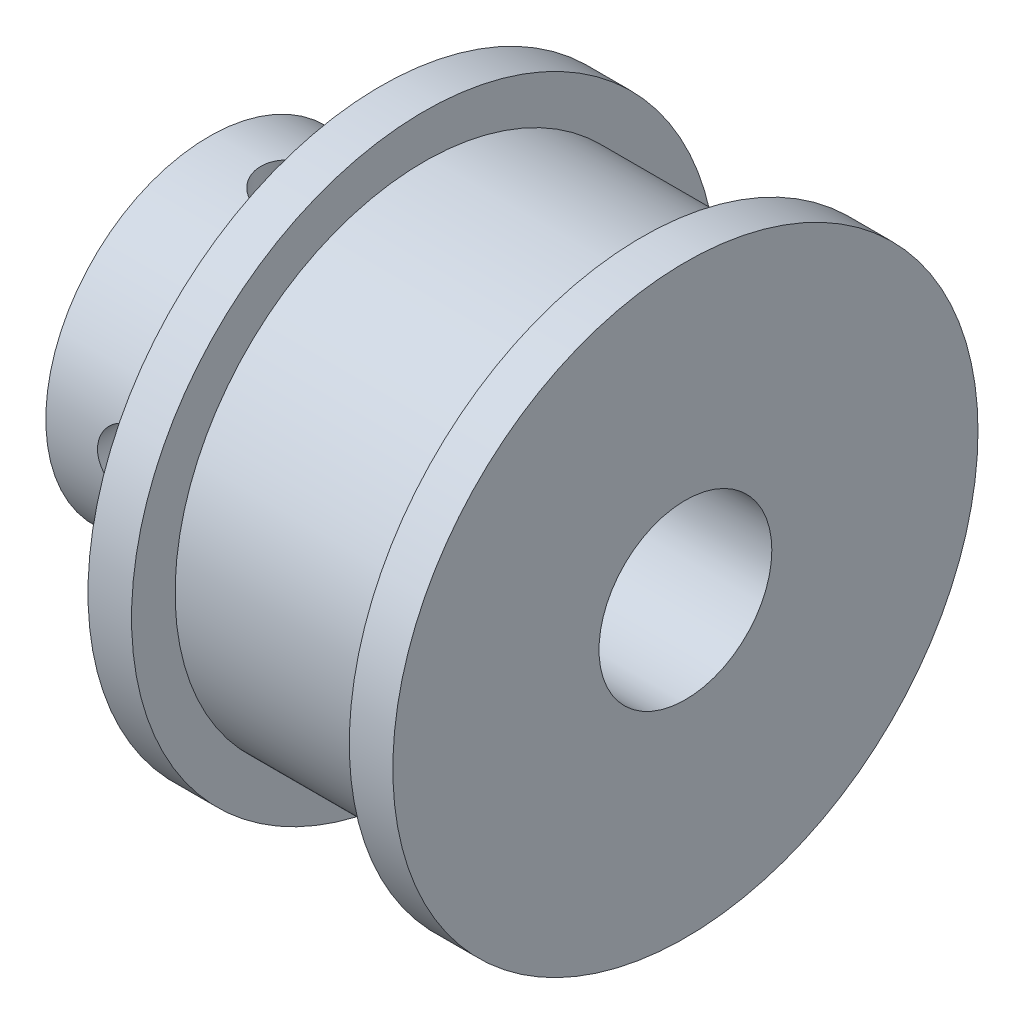
ISO-10303-21;
HEADER;
FILE_DESCRIPTION(('STEP AP214'),'2;1');
FILE_NAME('part.step','',(''),(''),'','','');
FILE_SCHEMA(('AUTOMOTIVE_DESIGN { 1 0 10303 214 1 1 1 1 }'));
ENDSEC;
DATA;
#1=APPLICATION_CONTEXT('core data for automotive mechanical design processes');
#2=APPLICATION_PROTOCOL_DEFINITION('international standard','automotive_design',2000,#1);
#3=PRODUCT_CONTEXT('',#1,'mechanical');
#4=PRODUCT('Part','Part','',(#3));
#5=PRODUCT_RELATED_PRODUCT_CATEGORY('part','',(#4));
#6=PRODUCT_DEFINITION_FORMATION('','',#4);
#7=PRODUCT_DEFINITION_CONTEXT('part definition',#1,'design');
#8=PRODUCT_DEFINITION('design','',#6,#7);
#9=PRODUCT_DEFINITION_SHAPE('','',#8);
#10=(LENGTH_UNIT() NAMED_UNIT(*) SI_UNIT(.MILLI.,.METRE.));
#11=(NAMED_UNIT(*) PLANE_ANGLE_UNIT() SI_UNIT($,.RADIAN.));
#12=(NAMED_UNIT(*) SI_UNIT($,.STERADIAN.) SOLID_ANGLE_UNIT());
#13=UNCERTAINTY_MEASURE_WITH_UNIT(LENGTH_MEASURE(1.E-05),#10,'distance_accuracy_value','');
#14=(GEOMETRIC_REPRESENTATION_CONTEXT(3) GLOBAL_UNCERTAINTY_ASSIGNED_CONTEXT((#13)) GLOBAL_UNIT_ASSIGNED_CONTEXT((#10,
#11,#12)) REPRESENTATION_CONTEXT('',''));
#15=CARTESIAN_POINT('',(0.,0.,0.));
#16=DIRECTION('',(0.,0.,1.));
#17=DIRECTION('',(1.,0.,0.));
#18=AXIS2_PLACEMENT_3D('',#15,#16,#17);
#19=CARTESIAN_POINT('',(0.,0.,0.));
#20=DIRECTION('',(1.,0.,0.));
#21=DIRECTION('',(0.,0.,-1.));
#22=AXIS2_PLACEMENT_3D('',#19,#20,#21);
#23=CYLINDRICAL_SURFACE('',#22,3.175);
#24=CARTESIAN_POINT('',(1.90000000000001,0.,3.175));
#25=CARTESIAN_POINT('',(1.9000068627745,0.0672847316330924,3.17499501338285));
#26=CARTESIAN_POINT('',(1.90546359305505,0.1346703640608,3.17283650663751));
#27=CARTESIAN_POINT('',(1.92710352845715,0.267542369031608,3.16441250521978));
#28=CARTESIAN_POINT('',(1.94331412522152,0.333023444641002,3.15813652319774));
#29=CARTESIAN_POINT('',(1.9857829777871,0.459957962416117,3.14215557601542));
#30=CARTESIAN_POINT('',(2.01200951215206,0.521423409993961,3.1324614438269));
#31=CARTESIAN_POINT('',(2.07364090841074,0.63903164640658,3.11060223187218));
#32=CARTESIAN_POINT('',(2.1090429677438,0.695176053354679,3.09843790684371));
#33=CARTESIAN_POINT('',(2.1897376821198,0.803199302091193,3.07224897424454));
#34=CARTESIAN_POINT('',(2.23538195508738,0.854801684849634,3.05816785515032));
#35=CARTESIAN_POINT('',(2.33452307874792,0.949851027050096,3.029995134943));
#36=CARTESIAN_POINT('',(2.38802352829044,0.993294227940917,3.01590353198658));
#37=CARTESIAN_POINT('',(2.5041424024409,1.07262244667806,2.98863572549245));
#38=CARTESIAN_POINT('',(2.56705314443539,1.10810421355732,2.97552454842956));
#39=CARTESIAN_POINT('',(2.698544027874,1.16785949338492,2.95258553832485));
#40=CARTESIAN_POINT('',(2.7671215628923,1.19213812572271,2.94275620617845));
#41=CARTESIAN_POINT('',(2.90482457540723,1.22768807019404,2.92809906106053));
#42=CARTESIAN_POINT('',(2.97379138336201,1.2394876533875,2.92306908743274));
#43=CARTESIAN_POINT('',(3.11289538673181,1.25139521634013,2.91799267608066));
#44=CARTESIAN_POINT('',(3.18303201481214,1.2515087076257,2.91794388907308));
#45=CARTESIAN_POINT('',(3.31747264612622,1.24044215294952,2.92266241514435));
#46=CARTESIAN_POINT('',(3.38185243388379,1.2300187638983,2.9271070555664));
#47=CARTESIAN_POINT('',(3.50786207063953,1.19943319152663,2.93977143360488));
#48=CARTESIAN_POINT('',(3.56949145415953,1.17926936651212,2.94799180758784));
#49=CARTESIAN_POINT('',(3.68970949878321,1.12939589279822,2.9674595549287));
#50=CARTESIAN_POINT('',(3.74821240698525,1.09950293840843,2.97876432051874));
#51=CARTESIAN_POINT('',(3.85958183190654,1.03114819003906,3.00311044973729));
#52=CARTESIAN_POINT('',(3.91244626347388,0.992683242204219,3.01615245182717));
#53=CARTESIAN_POINT('',(4.01519223792226,0.90489847311778,3.04369028436772));
#54=CARTESIAN_POINT('',(4.06455620057866,0.854982538626526,3.05822195069566));
#55=CARTESIAN_POINT('',(4.15437521291328,0.747422600693478,3.08627133748347));
#56=CARTESIAN_POINT('',(4.19482859712145,0.68977715576794,3.09978886808114));
#57=CARTESIAN_POINT('',(4.26632885010501,0.566964697663757,3.12460676760529));
#58=CARTESIAN_POINT('',(4.29718676961865,0.501677729871156,3.13586122258918));
#59=CARTESIAN_POINT('',(4.34730502697112,0.366284378650628,3.15453954285868));
#60=CARTESIAN_POINT('',(4.36657106552982,0.296180383098904,3.16196529078971));
#61=CARTESIAN_POINT('',(4.39192526522841,0.15748598181363,3.17180954080983));
#62=CARTESIAN_POINT('',(4.398709348115,0.08904145870925,3.174492125026));
#63=CARTESIAN_POINT('',(4.4009546291958,-0.0480536320474739,3.17537559014029));
#64=CARTESIAN_POINT('',(4.39641864995898,-0.116704144074904,3.17357758823769));
#65=CARTESIAN_POINT('',(4.3766688987383,-0.249146112043378,3.1658751934269));
#66=CARTESIAN_POINT('',(4.36192521803439,-0.313019327348947,3.16015168509209));
#67=CARTESIAN_POINT('',(4.32281288402532,-0.437330047990826,3.14535985768854));
#68=CARTESIAN_POINT('',(4.29844298886303,-0.497767108885045,3.1362911070673));
#69=CARTESIAN_POINT('',(4.23997777394203,-0.615550644692232,3.11535083253378));
#70=CARTESIAN_POINT('',(4.20560984846939,-0.672747743207499,3.10340262881889));
#71=CARTESIAN_POINT('',(4.12842792642724,-0.780761917259374,3.07800576012949));
#72=CARTESIAN_POINT('',(4.08561060602606,-0.831576469108153,3.06455650557748));
#73=CARTESIAN_POINT('',(3.98952965745297,-0.928791348114859,3.0365593899859));
#74=CARTESIAN_POINT('',(3.93577293586608,-0.974701227513619,3.02199629492691));
#75=CARTESIAN_POINT('',(3.82105274982168,-1.05696284943212,2.99421855171024));
#76=CARTESIAN_POINT('',(3.76008825217309,-1.09331321924023,2.98100409737911));
#77=CARTESIAN_POINT('',(3.63187774635261,-1.15559997165607,2.95742074651155));
#78=CARTESIAN_POINT('',(3.56458459593159,-1.18144907129597,2.9470759174758));
#79=CARTESIAN_POINT('',(3.4260725952737,-1.2212562072246,2.93080697789355));
#80=CARTESIAN_POINT('',(3.35485655568267,-1.23522264211379,2.92487974538276));
#81=CARTESIAN_POINT('',(3.21589405502895,-1.25007804085777,2.91855940228496));
#82=CARTESIAN_POINT('',(3.1482538653394,-1.25181430561831,2.91780781401761));
#83=CARTESIAN_POINT('',(3.01369577979596,-1.24437120429059,2.92098982763324));
#84=CARTESIAN_POINT('',(2.94677779981834,-1.23519312367105,2.92492287776943));
#85=CARTESIAN_POINT('',(2.81810207173594,-1.20686591196944,2.93671925445626));
#86=CARTESIAN_POINT('',(2.75624498467543,-1.18809939057282,2.9444313340829));
#87=CARTESIAN_POINT('',(2.63652982106708,-1.14148049607648,2.96281485611587));
#88=CARTESIAN_POINT('',(2.57867280512971,-1.1136257243581,2.97348707966731));
#89=CARTESIAN_POINT('',(2.4650674647447,-1.04781462002773,2.99733186522452));
#90=CARTESIAN_POINT('',(2.40961923756217,-1.00937948877753,3.01061106475901));
#91=CARTESIAN_POINT('',(2.30568987821778,-0.924206507043676,3.0378387527675));
#92=CARTESIAN_POINT('',(2.25721118976831,-0.877465757163235,3.05178747371865));
#93=CARTESIAN_POINT('',(2.16551587816836,-0.773553196077986,3.07982295515274));
#94=CARTESIAN_POINT('',(2.12281309958007,-0.715913819660185,3.09386447942524));
#95=CARTESIAN_POINT('',(2.04769454049986,-0.5937664037964,3.11960779538581));
#96=CARTESIAN_POINT('',(2.01528012935281,-0.529257451559142,3.13130927554577));
#97=CARTESIAN_POINT('',(1.96417540099936,-0.400855491445671,3.15020502613284));
#98=CARTESIAN_POINT('',(1.94455266817755,-0.337376283301317,3.15769788512325));
#99=CARTESIAN_POINT('',(1.91563614784328,-0.207895662632507,3.16884766902594));
#100=CARTESIAN_POINT('',(1.90631397142025,-0.141901703524203,3.17251513536217));
#101=CARTESIAN_POINT('',(1.90076135384054,-0.0504531001608372,3.17470085654944));
#102=CARTESIAN_POINT('',(1.8999974262687,-0.0252336457199433,3.17500187012012));
#103=CARTESIAN_POINT('',(1.90000000000001,0.,3.175));
#104=B_SPLINE_CURVE_WITH_KNOTS('',3,(#24,#25,#26,#27,#28,#29,#30,#31,#32,#33,#34,#35,#36,#37,
#38,#39,#40,#41,#42,#43,#44,#45,#46,#47,#48,#49,#50,#51,#52,#53,#54,#55,#56,#57,#58,#59,#60,#61,
#62,#63,#64,#65,#66,#67,#68,#69,#70,#71,#72,#73,#74,#75,#76,#77,#78,#79,#80,#81,#82,#83,#84,#85,
#86,#87,#88,#89,#90,#91,#92,#93,#94,#95,#96,#97,#98,#99,#100,#101,#102,#103),.UNSPECIFIED.,.T.,
.F.,(4,2,2,2,2,2,2,2,2,2,2,2,2,2,2,2,2,2,2,2,2,2,2,2,2,2,2,2,2,2,2,2,2,2,2,2,2,2,2,4),(0.,
0.201779437744548,0.404074820308127,0.605734757050763,0.807333171478417,1.01735976436243,
1.2274828705813,1.44660259463333,1.66562209023744,1.87494520835713,2.08416960269575,
2.27936669865592,2.47459670544107,2.67374147234743,2.87295963102294,3.08705517744558,
3.30119070642572,3.51930901537433,3.73731996902137,3.94275765182502,4.14814411546712,
4.34465147529728,4.54118419440118,4.7436789821994,4.94625358697288,5.1617892735487,
5.37735589340512,5.59467927329235,5.81184892233299,6.01381057507249,6.21574844354767,
6.41019345194811,6.60468982086286,6.81009090996547,7.01556384361703,7.2337987698656,
7.45206273023339,7.65177261299093,7.85093070050895,7.92660360165657),.UNSPECIFIED.);
#105=CARTESIAN_POINT('',(1.90000000000001,0.,3.175));
#106=VERTEX_POINT('',#105);
#107=EDGE_CURVE('E37',#106,#106,#104,.T.);
#108=ORIENTED_EDGE('',*,*,#107,.F.);
#109=EDGE_LOOP('',(#108));
#110=FACE_BOUND('',#109,.T.);
#111=CARTESIAN_POINT('',(3.15,2.91858270398493,-1.25));
#112=CARTESIAN_POINT('',(3.21705876770274,2.91858919552523,-1.24999286391997));
#113=CARTESIAN_POINT('',(3.28421776991305,2.92092645038722,-1.24457161253238));
#114=CARTESIAN_POINT('',(3.41661509708975,2.92998517442319,-1.2230858011541));
#115=CARTESIAN_POINT('',(3.48184795863823,2.93671805691524,-1.20699353198018));
#116=CARTESIAN_POINT('',(3.60825570633315,2.95367783504784,-1.16486992778129));
#117=CARTESIAN_POINT('',(3.66944461339327,2.96389181028401,-1.13887530486567));
#118=CARTESIAN_POINT('',(3.78657755098346,2.98664490940932,-1.07779173231123));
#119=CARTESIAN_POINT('',(3.84252284402701,2.99918347142755,-1.04270497949831));
#120=CARTESIAN_POINT('',(3.95071189018399,3.02595080926506,-0.962353829492942));
#121=CARTESIAN_POINT('',(4.00262881457917,3.04023283739072,-0.916666915264533));
#122=CARTESIAN_POINT('',(4.09830169841413,3.06843728874988,-0.817302314146456));
#123=CARTESIAN_POINT('',(4.1420548518516,3.08235958692784,-0.763621891133198));
#124=CARTESIAN_POINT('',(4.22176349783716,3.10891201177461,-0.64728579706301));
#125=CARTESIAN_POINT('',(4.25735944266869,3.12147292007291,-0.584366556004033));
#126=CARTESIAN_POINT('',(4.31732314068053,3.14324422109986,-0.452850465301555));
#127=CARTESIAN_POINT('',(4.34169532800117,3.15245593668199,-0.384255870461471));
#128=CARTESIAN_POINT('',(4.37736018254707,3.16611423056324,-0.2467608971739));
#129=CARTESIAN_POINT('',(4.38921442617454,3.17076466636064,-0.178026840226493));
#130=CARTESIAN_POINT('',(4.40131288966092,3.17551190440968,-0.0393983009347702));
#131=CARTESIAN_POINT('',(4.40156129942229,3.17561035000669,0.0304957535146294));
#132=CARTESIAN_POINT('',(4.39075388885007,3.17136802875332,0.165409649899385));
#133=CARTESIAN_POINT('',(4.380312782763,3.16726865978232,0.230487686315578));
#134=CARTESIAN_POINT('',(4.34946532592636,3.15541444614498,0.357881536818985));
#135=CARTESIAN_POINT('',(4.32905824593686,3.14765933397851,0.420197148407344));
#136=CARTESIAN_POINT('',(4.27860558354179,3.12910832817148,0.541410179653869));
#137=CARTESIAN_POINT('',(4.24842031728481,3.11826866169305,0.600242482304685));
#138=CARTESIAN_POINT('',(4.17939703639771,3.09462975143761,0.712157346885298));
#139=CARTESIAN_POINT('',(4.1405560971742,3.08182984578998,0.765237956392509));
#140=CARTESIAN_POINT('',(4.05243182003348,3.05461022779038,0.867739124124568));
#141=CARTESIAN_POINT('',(4.00264013608172,3.04013927358102,0.916709689716655));
#142=CARTESIAN_POINT('',(3.89548656480707,3.01184461230875,1.00578635680649));
#143=CARTESIAN_POINT('',(3.83812236311636,2.99802110488019,1.04588973818711));
#144=CARTESIAN_POINT('',(3.71550154425415,2.9722444532213,1.11707822475766));
#145=CARTESIAN_POINT('',(3.6500754582507,2.96035090580402,1.14789479354929));
#146=CARTESIAN_POINT('',(3.5143696785953,2.94047661183176,1.19789603572418));
#147=CARTESIAN_POINT('',(3.44409305117512,2.93249341875955,1.21708798384633));
#148=CARTESIAN_POINT('',(3.30516034266536,2.92193314346724,1.24221885837745));
#149=CARTESIAN_POINT('',(3.2366574611002,2.9190621155793,1.24887973581001));
#150=CARTESIAN_POINT('',(3.09946758767574,2.91821507641654,1.25085924710212));
#151=CARTESIAN_POINT('',(3.03078065469026,2.92023765193577,1.24618115550066));
#152=CARTESIAN_POINT('',(2.89910081239854,2.92864903711891,1.22627220656949));
#153=CARTESIAN_POINT('',(2.83600149325999,2.93479414330475,1.21162973372095));
#154=CARTESIAN_POINT('',(2.71319369775327,2.95045928061593,1.17296502005911));
#155=CARTESIAN_POINT('',(2.65348596177989,2.95998004539956,1.14894074010909));
#156=CARTESIAN_POINT('',(2.53650689226705,2.98178824537218,1.09112415058302));
#157=CARTESIAN_POINT('',(2.47942723563771,2.99417074871089,1.05698098829747));
#158=CARTESIAN_POINT('',(2.37155358654007,3.02015852173764,0.980258179031947));
#159=CARTESIAN_POINT('',(2.32076210314278,3.03376427580628,0.937675181950988));
#160=CARTESIAN_POINT('',(2.22315311375844,3.06183438952279,0.841703377564378));
#161=CARTESIAN_POINT('',(2.17687527629868,3.07629098175068,0.787761391689884));
#162=CARTESIAN_POINT('',(2.09394958907587,3.1035190255834,0.672529083864432));
#163=CARTESIAN_POINT('',(2.05730202921282,3.1162904264532,0.611238540780897));
#164=CARTESIAN_POINT('',(1.99484313276734,3.13873566281396,0.482904338615098));
#165=CARTESIAN_POINT('',(1.96901930828488,3.14841306493411,0.415867417631866));
#166=CARTESIAN_POINT('',(1.92917965457089,3.16357142711523,0.277927786036162));
#167=CARTESIAN_POINT('',(1.91515764017672,3.16905458518296,0.207027121129187));
#168=CARTESIAN_POINT('',(1.90003726977397,3.17497850608976,0.0682260342168539));
#169=CARTESIAN_POINT('',(1.89817498964644,3.17571727826717,0.000420884757595325));
#170=CARTESIAN_POINT('',(1.90542306137319,3.1728670277863,-0.134500374630681));
#171=CARTESIAN_POINT('',(1.9145318409792,3.16927862524971,-0.201616581901098));
#172=CARTESIAN_POINT('',(1.94291936225415,3.15832315585951,-0.331261459507754));
#173=CARTESIAN_POINT('',(1.96189513645233,3.15106882901496,-0.393866748155006));
#174=CARTESIAN_POINT('',(2.00916415022582,3.13355246801338,-0.514998013360591));
#175=CARTESIAN_POINT('',(2.03745913359075,3.12328987099511,-0.573523223978585));
#176=CARTESIAN_POINT('',(2.10396081746341,3.10021124636329,-0.687642991756168));
#177=CARTESIAN_POINT('',(2.14254680575914,3.08730319204293,-0.742997519181306));
#178=CARTESIAN_POINT('',(2.22796048608835,3.0604965861267,-0.846674739986252));
#179=CARTESIAN_POINT('',(2.27479143506869,3.04659764440369,-0.894994640697079));
#180=CARTESIAN_POINT('',(2.3786645370051,3.01835076024438,-0.986204093974814));
#181=CARTESIAN_POINT('',(2.43614870477354,3.00402537078839,-1.02859889387657));
#182=CARTESIAN_POINT('',(2.55787929604743,2.97745127531598,-1.10316965268165));
#183=CARTESIAN_POINT('',(2.62212660256846,2.96520284101944,-1.13534427499941));
#184=CARTESIAN_POINT('',(2.74980593068555,2.94527735121899,-1.18601952811124));
#185=CARTESIAN_POINT('',(2.81281216952646,2.93729286701932,-1.20547430735444));
#186=CARTESIAN_POINT('',(2.94135798876503,2.92533709276108,-1.23421212719399));
#187=CARTESIAN_POINT('',(3.00688989438575,2.92135450819833,-1.24352380081826));
#188=CARTESIAN_POINT('',(3.09843968257498,2.91892238480656,-1.24920484852849));
#189=CARTESIAN_POINT('',(3.12421242994352,2.91858020765141,-1.25000274419244));
#190=CARTESIAN_POINT('',(3.15,2.91858270398493,-1.25));
#191=B_SPLINE_CURVE_WITH_KNOTS('',3,(#111,#112,#113,#114,#115,#116,#117,#118,#119,#120,#121,
#122,#123,#124,#125,#126,#127,#128,#129,#130,#131,#132,#133,#134,#135,#136,#137,#138,#139,#140,
#141,#142,#143,#144,#145,#146,#147,#148,#149,#150,#151,#152,#153,#154,#155,#156,#157,#158,#159,
#160,#161,#162,#163,#164,#165,#166,#167,#168,#169,#170,#171,#172,#173,#174,#175,#176,#177,#178,
#179,#180,#181,#182,#183,#184,#185,#186,#187,#188,#189,#190),.UNSPECIFIED.,.T.,.F.,(4,2,2,2,2,2,
2,2,2,2,2,2,2,2,2,2,2,2,2,2,2,2,2,2,2,2,2,2,2,2,2,2,2,2,2,2,2,2,2,4),(0.,0.20109806062216,
0.402720363484106,0.603602331741175,0.804435808400704,1.01535170829682,1.22633996993093,
1.44534686764129,1.66426716849029,1.87288447318198,2.08142646291369,2.27861453584364,
2.47581703977309,2.67597098178837,2.87619265497002,3.08919652800103,3.30226565219754,
3.52100766319138,3.73961264265535,3.94518390476032,4.1506958077731,4.34501913391243,
4.5393847197749,4.74148953365143,4.94367473209367,5.16024174600764,5.37681527848653,
5.59313824650931,5.80934777198827,6.01183163883026,6.21428649142563,6.41086299855999,
6.60747630956881,6.81268639074811,7.01797771720266,7.23549456942807,7.45303985660975,
7.65144122721413,7.84928106635439,7.92661368823473),.UNSPECIFIED.);
#192=CARTESIAN_POINT('',(3.15,2.91858270398493,-1.25));
#193=VERTEX_POINT('',#192);
#194=EDGE_CURVE('E52',#193,#193,#191,.T.);
#195=ORIENTED_EDGE('',*,*,#194,.F.);
#196=EDGE_LOOP('',(#195));
#197=FACE_BOUND('',#196,.T.);
#198=CARTESIAN_POINT('',(17.5,0.,0.));
#199=DIRECTION('',(1.,0.,0.));
#200=DIRECTION('',(0.,0.,-1.));
#201=AXIS2_PLACEMENT_3D('',#198,#199,#200);
#202=CIRCLE('',#201,3.175);
#203=CARTESIAN_POINT('',(17.5,0.,-3.175));
#204=VERTEX_POINT('',#203);
#205=EDGE_CURVE('E76',#204,#204,#202,.T.);
#206=ORIENTED_EDGE('',*,*,#205,.T.);
#207=EDGE_LOOP('',(#206));
#208=FACE_BOUND('',#207,.T.);
#209=CARTESIAN_POINT('',(0.,0.,0.));
#210=DIRECTION('',(1.,0.,0.));
#211=DIRECTION('',(0.,0.,-1.));
#212=AXIS2_PLACEMENT_3D('',#209,#210,#211);
#213=CIRCLE('',#212,3.175);
#214=CARTESIAN_POINT('',(0.,0.,-3.175));
#215=VERTEX_POINT('',#214);
#216=EDGE_CURVE('E10',#215,#215,#213,.T.);
#217=ORIENTED_EDGE('',*,*,#216,.F.);
#218=EDGE_LOOP('',(#217));
#219=FACE_BOUND('',#218,.T.);
#220=ADVANCED_FACE('F33',(#110,#197,#208,#219),#23,.F.);
#221=CARTESIAN_POINT('',(0.,3.175,0.));
#222=DIRECTION('',(-1.,0.,0.));
#223=DIRECTION('',(0.,0.,1.));
#224=AXIS2_PLACEMENT_3D('',#221,#222,#223);
#225=PLANE('',#224);
#226=ORIENTED_EDGE('',*,*,#216,.T.);
#227=EDGE_LOOP('',(#226));
#228=FACE_BOUND('',#227,.T.);
#229=CARTESIAN_POINT('',(0.,0.,0.));
#230=DIRECTION('',(1.,0.,0.));
#231=DIRECTION('',(0.,0.,-1.));
#232=AXIS2_PLACEMENT_3D('',#229,#230,#231);
#233=CIRCLE('',#232,6.);
#234=CARTESIAN_POINT('',(0.,0.,-6.));
#235=VERTEX_POINT('',#234);
#236=EDGE_CURVE('E44',#235,#235,#233,.T.);
#237=ORIENTED_EDGE('',*,*,#236,.F.);
#238=EDGE_LOOP('',(#237));
#239=FACE_BOUND('',#238,.T.);
#240=ADVANCED_FACE('F85',(#228,#239),#225,.T.);
#241=CARTESIAN_POINT('',(0.,0.,0.));
#242=DIRECTION('',(1.,0.,0.));
#243=DIRECTION('',(0.,0.,-1.));
#244=AXIS2_PLACEMENT_3D('',#241,#242,#243);
#245=CYLINDRICAL_SURFACE('',#244,6.);
#246=CARTESIAN_POINT('',(1.90000000000001,0.,6.));
#247=CARTESIAN_POINT('',(1.90000247746923,-0.0694090417016603,5.99999871526651));
#248=CARTESIAN_POINT('',(1.90580066571876,-0.138848789520875,5.99878328775043));
#249=CARTESIAN_POINT('',(1.92881934953286,-0.275761316266992,5.99405200990679));
#250=CARTESIAN_POINT('',(1.94604852303694,-0.343232560128311,5.99053441189248));
#251=CARTESIAN_POINT('',(1.99137045492183,-0.474209132291339,5.98159109196202));
#252=CARTESIAN_POINT('',(2.01945239599889,-0.537718336709182,5.97616727052645));
#253=CARTESIAN_POINT('',(2.08564960885619,-0.659120328605954,5.96399927809859));
#254=CARTESIAN_POINT('',(2.12376443115584,-0.717013367534323,5.95725516625975));
#255=CARTESIAN_POINT('',(2.20953634019065,-0.826390324308832,5.9430770002465));
#256=CARTESIAN_POINT('',(2.25731200123509,-0.87778024416268,5.93563505848531));
#257=CARTESIAN_POINT('',(2.36079465919511,-0.971877776769387,5.92095657692448));
#258=CARTESIAN_POINT('',(2.41650231187227,-1.01458467096098,5.91372005416683));
#259=CARTESIAN_POINT('',(2.53495196876616,-1.09051031677216,5.90019442595308));
#260=CARTESIAN_POINT('',(2.59775838450275,-1.1236305468065,5.89391545174828));
#261=CARTESIAN_POINT('',(2.72819745177276,-1.17881119348063,5.8831284065002));
#262=CARTESIAN_POINT('',(2.79582958244254,-1.20087280167641,5.87862014467568));
#263=CARTESIAN_POINT('',(2.93298523741564,-1.23300240133736,5.87196500986123));
#264=CARTESIAN_POINT('',(3.00246835933477,-1.24323597696798,5.86978556855865));
#265=CARTESIAN_POINT('',(3.14219684286263,-1.25193357655614,5.86793690716491));
#266=CARTESIAN_POINT('',(3.2124421188653,-1.25039890894686,5.86826740800981));
#267=CARTESIAN_POINT('',(3.35048102797518,-1.23573719037196,5.87137174319175));
#268=CARTESIAN_POINT('',(3.41829597966121,-1.2228010523272,5.87410533679901));
#269=CARTESIAN_POINT('',(3.55077150964493,-1.18600543529945,5.88164437615942));
#270=CARTESIAN_POINT('',(3.61543192560633,-1.16214539481381,5.88644992841317));
#271=CARTESIAN_POINT('',(3.74030722841598,-1.10400003213928,5.89763191464102));
#272=CARTESIAN_POINT('',(3.80048629652707,-1.06964002534236,5.90401953785586));
#273=CARTESIAN_POINT('',(3.91429574426816,-0.991522699274812,5.91763890010721));
#274=CARTESIAN_POINT('',(3.96792530883597,-0.947764212262582,5.92487074398537));
#275=CARTESIAN_POINT('',(4.06821396108037,-0.851074921546777,5.93953730929909));
#276=CARTESIAN_POINT('',(4.11471616889701,-0.797981433412077,5.94697323199473));
#277=CARTESIAN_POINT('',(4.19818044222897,-0.684667288611794,5.96108088143001));
#278=CARTESIAN_POINT('',(4.23514236459839,-0.624446525025762,5.96775259670236));
#279=CARTESIAN_POINT('',(4.29851008153595,-0.498405541235475,5.97959870942815));
#280=CARTESIAN_POINT('',(4.32489680456711,-0.432575461926497,5.98477039710258));
#281=CARTESIAN_POINT('',(4.36619170483549,-0.297284620972153,5.99301338211281));
#282=CARTESIAN_POINT('',(4.38110139323139,-0.227824338595088,5.99608495596053));
#283=CARTESIAN_POINT('',(4.39879425206788,-0.0885918657008349,5.99974275215455));
#284=CARTESIAN_POINT('',(4.40179194149424,-0.0188480555261788,6.00037293537579));
#285=CARTESIAN_POINT('',(4.39615505003089,0.120143798757714,5.99919952252774));
#286=CARTESIAN_POINT('',(4.3875211813984,0.189391872962257,5.99739607548153));
#287=CARTESIAN_POINT('',(4.35904434653046,0.324726367119811,5.99158564979184));
#288=CARTESIAN_POINT('',(4.33931251461653,0.390837192894204,5.98760052868077));
#289=CARTESIAN_POINT('',(4.28932213957859,0.518811446661328,5.97787227242395));
#290=CARTESIAN_POINT('',(4.25906275913401,0.580674536336772,5.97212899744579));
#291=CARTESIAN_POINT('',(4.18841962176244,0.69929430694349,5.95941241490714));
#292=CARTESIAN_POINT('',(4.14790807043093,0.755973219469829,5.9524239381233));
#293=CARTESIAN_POINT('',(4.05808043692373,0.861805445886515,5.93802568299709));
#294=CARTESIAN_POINT('',(4.00876332448106,0.910957877913281,5.93061585542511));
#295=CARTESIAN_POINT('',(3.9017444230003,1.0011786486518,5.91606024531377));
#296=CARTESIAN_POINT('',(3.84391696804472,1.04209914600204,5.90892089307501));
#297=CARTESIAN_POINT('',(3.72208371578621,1.11364719079243,5.89585601015805));
#298=CARTESIAN_POINT('',(3.65807817586089,1.14427516677863,5.88993042894651));
#299=CARTESIAN_POINT('',(3.52603880370177,1.19417246443921,5.88001700708041));
#300=CARTESIAN_POINT('',(3.45802896283416,1.21350309828031,5.87601872784687));
#301=CARTESIAN_POINT('',(3.31963344950774,1.24044038523407,5.87039184709697));
#302=CARTESIAN_POINT('',(3.24924811838056,1.2480487154444,5.86876290660367));
#303=CARTESIAN_POINT('',(3.10958659900035,1.25125926487611,5.86807907308506));
#304=CARTESIAN_POINT('',(3.04031592977795,1.24709542622725,5.86897402321502));
#305=CARTESIAN_POINT('',(2.90348599107978,1.22739905314031,5.87312447254928));
#306=CARTESIAN_POINT('',(2.8359267051839,1.21186662782265,5.87637994909626));
#307=CARTESIAN_POINT('',(2.70460222810934,1.16998217768584,5.88486132447716));
#308=CARTESIAN_POINT('',(2.64082675351308,1.14366117568421,5.8900815700793));
#309=CARTESIAN_POINT('',(2.51856122397334,1.08097457299757,5.90190705738738));
#310=CARTESIAN_POINT('',(2.46007166036688,1.04460803983029,5.9085124276546));
#311=CARTESIAN_POINT('',(2.34887837292056,0.962073695342405,5.92251579551146));
#312=CARTESIAN_POINT('',(2.29630087543502,0.91573789041822,5.92992613868404));
#313=CARTESIAN_POINT('',(2.19959050677365,0.814924438115329,5.94461839583213));
#314=CARTESIAN_POINT('',(2.15545958244852,0.760444918832963,5.9519002798488));
#315=CARTESIAN_POINT('',(2.07641142681595,0.644134427507699,5.96561444547637));
#316=CARTESIAN_POINT('',(2.04160632011372,0.582225921521345,5.97203596073244));
#317=CARTESIAN_POINT('',(1.98294977156998,0.453319843998451,5.98319908494092));
#318=CARTESIAN_POINT('',(1.95908875281813,0.386326781907242,5.98794216182101));
#319=CARTESIAN_POINT('',(1.92745972171158,0.266015292900104,5.99432499781443));
#320=CARTESIAN_POINT('',(1.91718123679115,0.213367593727928,5.99644035661395));
#321=CARTESIAN_POINT('',(1.90345054572268,0.107152674176536,5.99927832789758));
#322=CARTESIAN_POINT('',(1.89999808733282,0.0535854878488715,6.00000099184586));
#323=CARTESIAN_POINT('',(1.90000000000001,0.,6.));
#324=B_SPLINE_CURVE_WITH_KNOTS('',3,(#246,#247,#248,#249,#250,#251,#252,#253,#254,#255,#256,
#257,#258,#259,#260,#261,#262,#263,#264,#265,#266,#267,#268,#269,#270,#271,#272,#273,#274,#275,
#276,#277,#278,#279,#280,#281,#282,#283,#284,#285,#286,#287,#288,#289,#290,#291,#292,#293,#294,
#295,#296,#297,#298,#299,#300,#301,#302,#303,#304,#305,#306,#307,#308,#309,#310,#311,#312,#313,
#314,#315,#316,#317,#318,#319,#320,#321,#322,#323),.UNSPECIFIED.,.T.,.F.,(4,2,2,2,2,2,2,2,2,2,2,
2,2,2,2,2,2,2,2,2,2,2,2,2,2,2,2,2,2,2,2,2,2,2,2,2,2,2,4),(0.,0.208031045103182,
0.416220199906223,0.624202378825439,0.832175241572985,1.04287526388122,1.25359271551785,
1.46640449178548,1.67919333285489,1.88896575169853,2.09871484767163,2.30501712129058,
2.51133000030278,2.71914592416748,2.92698768368033,3.13889526355464,3.35080602278216,
3.5630972449966,3.77536051045769,3.98378339407673,4.19219351552275,4.39855286632619,
4.60492863390931,4.81401583995734,5.02312752564571,5.23571263829333,5.44828889851306,
5.65970050095022,5.87108185414182,6.07829223291035,6.28550062281358,6.49211731393252,
6.69875319081476,6.90919024830305,7.11967575117366,7.33258864398252,7.54531486464969,
7.70592588477276,7.86653096973387),.UNSPECIFIED.);
#325=CARTESIAN_POINT('',(1.90000000000001,0.,6.));
#326=VERTEX_POINT('',#325);
#327=EDGE_CURVE('E58',#326,#326,#324,.T.);
#328=ORIENTED_EDGE('',*,*,#327,.F.);
#329=EDGE_LOOP('',(#328));
#330=FACE_BOUND('',#329,.T.);
#331=CARTESIAN_POINT('',(3.15,5.86834729715275,-1.25));
#332=CARTESIAN_POINT('',(3.08060938484897,5.86834869213645,-1.24999750877599));
#333=CARTESIAN_POINT('',(3.01118802798478,5.86959145924544,-1.24420229433948));
#334=CARTESIAN_POINT('',(2.87431368268275,5.87442015581798,-1.22119649233779));
#335=CARTESIAN_POINT('',(2.80686224449358,5.87800788138388,-1.20397715440342));
#336=CARTESIAN_POINT('',(2.67592762716513,5.8871029296193,-1.1586839750723));
#337=CARTESIAN_POINT('',(2.6124404040082,5.89260825706945,-1.13062141248932));
#338=CARTESIAN_POINT('',(2.4910755003544,5.90491581335741,-1.06446988601732));
#339=CARTESIAN_POINT('',(2.43319759326998,5.91171798977622,-1.0263813273582));
#340=CARTESIAN_POINT('',(2.32380462484654,5.92596934661468,-0.940636399466082));
#341=CARTESIAN_POINT('',(2.27238810637353,5.93342614373039,-0.892855554869668));
#342=CARTESIAN_POINT('',(2.1782389313519,5.94807966802575,-0.789351223880636));
#343=CARTESIAN_POINT('',(2.13550691170856,5.95527637609915,-0.733627155456002));
#344=CARTESIAN_POINT('',(2.05955411191714,5.96868135118848,-0.615162052999588));
#345=CARTESIAN_POINT('',(2.02642747353674,5.97487958631242,-0.552359428204941));
#346=CARTESIAN_POINT('',(1.97123394714022,5.98550347343302,-0.421928551006719));
#347=CARTESIAN_POINT('',(1.94916593484647,5.98992930561222,-0.354300789950591));
#348=CARTESIAN_POINT('',(1.91702423888253,5.99645589892179,-0.217162904200502));
#349=CARTESIAN_POINT('',(1.90678398280484,5.99858891959926,-0.147693380916357));
#350=CARTESIAN_POINT('',(1.89806830424298,6.00040112580612,-0.00799184883952432));
#351=CARTESIAN_POINT('',(1.8995916558069,6.0000805670369,0.0622400797368385));
#352=CARTESIAN_POINT('',(1.91423460095674,5.99704658090511,0.200326586199572));
#353=CARTESIAN_POINT('',(1.92717471895812,5.99437018956584,0.268201128726475));
#354=CARTESIAN_POINT('',(1.96399862533131,5.98696720898885,0.400793746289752));
#355=CARTESIAN_POINT('',(1.98788287720308,5.98224053291904,0.465511687511022));
#356=CARTESIAN_POINT('',(2.0460800521255,5.97120767323924,0.590460005384683));
#357=CARTESIAN_POINT('',(2.08046229420966,5.96489104125346,0.65065713498165));
#358=CARTESIAN_POINT('',(2.15862800284042,5.95137300440189,0.764493456510647));
#359=CARTESIAN_POINT('',(2.20241263820613,5.94417148958325,0.818131831816418));
#360=CARTESIAN_POINT('',(2.29912162489106,5.92951700233276,0.918394203276912));
#361=CARTESIAN_POINT('',(2.35220305998195,5.92206184975925,0.964866487494794));
#362=CARTESIAN_POINT('',(2.4654820489948,5.90786872648996,1.04827597240488));
#363=CARTESIAN_POINT('',(2.52567976138724,5.9011307717716,1.0852129606998));
#364=CARTESIAN_POINT('',(2.6517122548288,5.88912998409156,1.14856217138454));
#365=CARTESIAN_POINT('',(2.71756065069343,5.88387085232125,1.17494805489727));
#366=CARTESIAN_POINT('',(2.85289161936939,5.8754760641036,1.21623577538673));
#367=CARTESIAN_POINT('',(2.92237367280809,5.87234010507182,1.23113924882349));
#368=CARTESIAN_POINT('',(3.06161970631891,5.86860783239132,1.24880863867017));
#369=CARTESIAN_POINT('',(3.13135458453703,5.86796551863474,1.25179442917998));
#370=CARTESIAN_POINT('',(3.27032581154014,5.86916952018704,1.24613693439294));
#371=CARTESIAN_POINT('',(3.33956219090234,5.87101568152623,1.23749436857863));
#372=CARTESIAN_POINT('',(3.47482051605812,5.87694538226166,1.20901558325484));
#373=CARTESIAN_POINT('',(3.54086866717883,5.88100511282998,1.18929841376871));
#374=CARTESIAN_POINT('',(3.6687239894416,5.8908833850312,1.13935810860919));
#375=CARTESIAN_POINT('',(3.7305307856504,5.89670208191057,1.10913404556146));
#376=CARTESIAN_POINT('',(3.84910644121623,5.90954501937191,1.03854598181485));
#377=CARTESIAN_POINT('',(3.90579220446617,5.91658506648323,0.998045327353962));
#378=CARTESIAN_POINT('',(4.01164324915506,5.93103483993908,0.908234440569878));
#379=CARTESIAN_POINT('',(4.06080768623923,5.93844460766532,0.858923220505172));
#380=CARTESIAN_POINT('',(4.15106271309716,5.95294924316736,0.751900450843339));
#381=CARTESIAN_POINT('',(4.19200409502638,5.9600367471991,0.694061907614551));
#382=CARTESIAN_POINT('',(4.26358875208798,5.97296708772407,0.57220010221636));
#383=CARTESIAN_POINT('',(4.29423248223745,5.97880997920818,0.508177113476881));
#384=CARTESIAN_POINT('',(4.34413867931735,5.98856148270679,0.376142117847919));
#385=CARTESIAN_POINT('',(4.36346916554434,5.99248163136497,0.308156710970195));
#386=CARTESIAN_POINT('',(4.3904144040081,5.99799561410226,0.169813400503473));
#387=CARTESIAN_POINT('',(4.39803069353274,5.99958975342889,0.0994558094616958));
#388=CARTESIAN_POINT('',(4.40126762204851,6.00026408056941,-0.0402133434703387));
#389=CARTESIAN_POINT('',(4.39711189999473,5.99939113754811,-0.109519592177922));
#390=CARTESIAN_POINT('',(4.37741936134707,5.99532874094472,-0.246422870373552));
#391=CARTESIAN_POINT('',(4.36188271359323,5.99213932172839,-0.314019925202702));
#392=CARTESIAN_POINT('',(4.31997220535144,5.98380460077544,-0.445431965492052));
#393=CARTESIAN_POINT('',(4.29362733614689,5.97866453407556,-0.509256550004524));
#394=CARTESIAN_POINT('',(4.230877602268,5.96697995347704,-0.631610567220741));
#395=CARTESIAN_POINT('',(4.19447186165686,5.96043531730246,-0.690139538279511));
#396=CARTESIAN_POINT('',(4.11189033200669,5.94651596786386,-0.80134032129826));
#397=CARTESIAN_POINT('',(4.0655557119433,5.93912880302851,-0.853892633615926));
#398=CARTESIAN_POINT('',(3.96475549900292,5.9244278681135,-0.950552741980385));
#399=CARTESIAN_POINT('',(3.91028797005157,5.91711411595368,-0.994658521571232));
#400=CARTESIAN_POINT('',(3.79399089756656,5.90329191643327,-1.07367451852767));
#401=CARTESIAN_POINT('',(3.73208158853791,5.89679406702551,-1.10846928126994));
#402=CARTESIAN_POINT('',(3.60317484391674,5.88547039658063,-1.16710627925306));
#403=CARTESIAN_POINT('',(3.53618195154699,5.88064310352601,-1.1909581629246));
#404=CARTESIAN_POINT('',(3.41589371843157,5.87414004405196,-1.22256554131861));
#405=CARTESIAN_POINT('',(3.36327046340695,5.87198163591589,-1.2328344900567));
#406=CARTESIAN_POINT('',(3.25710421947899,5.86908475266778,-1.24655254358404));
#407=CARTESIAN_POINT('',(3.20356126768996,5.86834622039193,-1.25000192292741));
#408=CARTESIAN_POINT('',(3.15,5.86834729715275,-1.25));
#409=B_SPLINE_CURVE_WITH_KNOTS('',3,(#331,#332,#333,#334,#335,#336,#337,#338,#339,#340,#341,
#342,#343,#344,#345,#346,#347,#348,#349,#350,#351,#352,#353,#354,#355,#356,#357,#358,#359,#360,
#361,#362,#363,#364,#365,#366,#367,#368,#369,#370,#371,#372,#373,#374,#375,#376,#377,#378,#379,
#380,#381,#382,#383,#384,#385,#386,#387,#388,#389,#390,#391,#392,#393,#394,#395,#396,#397,#398,
#399,#400,#401,#402,#403,#404,#405,#406,#407,#408),.UNSPECIFIED.,.T.,.F.,(4,2,2,2,2,2,2,2,2,2,2,
2,2,2,2,2,2,2,2,2,2,2,2,2,2,2,2,2,2,2,2,2,2,2,2,2,2,2,4),(0.,0.207975654071269,0.41611079241747,
0.624030014802729,0.831940834815791,1.04271333467885,1.25350128663874,1.46629026266844,
1.67905760106933,1.88879048859264,2.09850151896339,2.30497341416461,2.5114540545587,
2.71932871977949,2.9272292410426,3.13905862244913,3.35089272191628,3.56325237332487,
3.77558175387597,3.98397516009792,4.19235567296524,4.39853786231922,4.60473825464031,
4.81383917934651,5.02296356082185,5.23559458753343,5.4482162175904,5.65954599648534,
5.87084803959581,6.07816293922644,6.28547476332981,6.492234105851,6.69901145528173,
6.90938318978573,7.11980508427535,7.33272651358123,7.54545984571988,7.70599867585769,
7.8665310426116),.UNSPECIFIED.);
#410=CARTESIAN_POINT('',(3.15,5.86834729715275,-1.25));
#411=VERTEX_POINT('',#410);
#412=EDGE_CURVE('E57',#411,#411,#409,.T.);
#413=ORIENTED_EDGE('',*,*,#412,.F.);
#414=EDGE_LOOP('',(#413));
#415=FACE_BOUND('',#414,.T.);
#416=ORIENTED_EDGE('',*,*,#236,.T.);
#417=EDGE_LOOP('',(#416));
#418=FACE_BOUND('',#417,.T.);
#419=CARTESIAN_POINT('',(6.3,0.,0.));
#420=DIRECTION('',(1.,0.,0.));
#421=DIRECTION('',(0.,0.,-1.));
#422=AXIS2_PLACEMENT_3D('',#419,#420,#421);
#423=CIRCLE('',#422,6.);
#424=CARTESIAN_POINT('',(6.3,0.,-6.));
#425=VERTEX_POINT('',#424);
#426=EDGE_CURVE('E49',#425,#425,#423,.T.);
#427=ORIENTED_EDGE('',*,*,#426,.F.);
#428=EDGE_LOOP('',(#427));
#429=FACE_BOUND('',#428,.T.);
#430=ADVANCED_FACE('F80',(#330,#415,#418,#429),#245,.T.);
#431=CARTESIAN_POINT('',(6.3,10.75,0.));
#432=DIRECTION('',(-1.,0.,0.));
#433=DIRECTION('',(0.,0.,1.));
#434=AXIS2_PLACEMENT_3D('',#431,#432,#433);
#435=PLANE('',#434);
#436=ORIENTED_EDGE('',*,*,#426,.T.);
#437=EDGE_LOOP('',(#436));
#438=FACE_BOUND('',#437,.T.);
#439=CARTESIAN_POINT('',(6.3,0.,0.));
#440=DIRECTION('',(1.,0.,0.));
#441=DIRECTION('',(0.,0.,-1.));
#442=AXIS2_PLACEMENT_3D('',#439,#440,#441);
#443=CIRCLE('',#442,10.75);
#444=CARTESIAN_POINT('',(6.3,0.,-10.75));
#445=VERTEX_POINT('',#444);
#446=EDGE_CURVE('E101',#445,#445,#443,.T.);
#447=ORIENTED_EDGE('',*,*,#446,.F.);
#448=EDGE_LOOP('',(#447));
#449=FACE_BOUND('',#448,.T.);
#450=ADVANCED_FACE('F84',(#438,#449),#435,.T.);
#451=CARTESIAN_POINT('',(0.,0.,0.));
#452=DIRECTION('',(1.,0.,0.));
#453=DIRECTION('',(0.,0.,-1.));
#454=AXIS2_PLACEMENT_3D('',#451,#452,#453);
#455=CYLINDRICAL_SURFACE('',#454,10.75);
#456=ORIENTED_EDGE('',*,*,#446,.T.);
#457=EDGE_LOOP('',(#456));
#458=FACE_BOUND('',#457,.T.);
#459=CARTESIAN_POINT('',(7.9,0.,0.));
#460=DIRECTION('',(1.,0.,0.));
#461=DIRECTION('',(0.,0.,-1.));
#462=AXIS2_PLACEMENT_3D('',#459,#460,#461);
#463=CIRCLE('',#462,10.75);
#464=CARTESIAN_POINT('',(7.9,0.,-10.75));
#465=VERTEX_POINT('',#464);
#466=EDGE_CURVE('E103',#465,#465,#463,.T.);
#467=ORIENTED_EDGE('',*,*,#466,.F.);
#468=EDGE_LOOP('',(#467));
#469=FACE_BOUND('',#468,.T.);
#470=ADVANCED_FACE('F145',(#458,#469),#455,.T.);
#471=CARTESIAN_POINT('',(7.9,10.75,0.));
#472=DIRECTION('',(1.,0.,0.));
#473=DIRECTION('',(0.,0.,-1.));
#474=AXIS2_PLACEMENT_3D('',#471,#472,#473);
#475=PLANE('',#474);
#476=ORIENTED_EDGE('',*,*,#466,.T.);
#477=EDGE_LOOP('',(#476));
#478=FACE_BOUND('',#477,.T.);
#479=CARTESIAN_POINT('',(7.9,0.,0.));
#480=DIRECTION('',(1.,0.,0.));
#481=DIRECTION('',(0.,0.,-1.));
#482=AXIS2_PLACEMENT_3D('',#479,#480,#481);
#483=CIRCLE('',#482,9.15);
#484=CARTESIAN_POINT('',(7.9,0.,-9.15));
#485=VERTEX_POINT('',#484);
#486=EDGE_CURVE('E108',#485,#485,#483,.T.);
#487=ORIENTED_EDGE('',*,*,#486,.F.);
#488=EDGE_LOOP('',(#487));
#489=FACE_BOUND('',#488,.T.);
#490=ADVANCED_FACE('F142',(#478,#489),#475,.T.);
#491=CARTESIAN_POINT('',(0.,0.,0.));
#492=DIRECTION('',(1.,0.,0.));
#493=DIRECTION('',(0.,0.,-1.));
#494=AXIS2_PLACEMENT_3D('',#491,#492,#493);
#495=CYLINDRICAL_SURFACE('',#494,9.15);
#496=ORIENTED_EDGE('',*,*,#486,.T.);
#497=EDGE_LOOP('',(#496));
#498=FACE_BOUND('',#497,.T.);
#499=CARTESIAN_POINT('',(15.9,0.,0.));
#500=DIRECTION('',(1.,0.,0.));
#501=DIRECTION('',(0.,0.,-1.));
#502=AXIS2_PLACEMENT_3D('',#499,#500,#501);
#503=CIRCLE('',#502,9.15);
#504=CARTESIAN_POINT('',(15.9,0.,-9.15));
#505=VERTEX_POINT('',#504);
#506=EDGE_CURVE('E111',#505,#505,#503,.T.);
#507=ORIENTED_EDGE('',*,*,#506,.F.);
#508=EDGE_LOOP('',(#507));
#509=FACE_BOUND('',#508,.T.);
#510=ADVANCED_FACE('F135',(#498,#509),#495,.T.);
#511=CARTESIAN_POINT('',(15.9,9.15,0.));
#512=DIRECTION('',(-1.,0.,0.));
#513=DIRECTION('',(0.,0.,1.));
#514=AXIS2_PLACEMENT_3D('',#511,#512,#513);
#515=PLANE('',#514);
#516=ORIENTED_EDGE('',*,*,#506,.T.);
#517=EDGE_LOOP('',(#516));
#518=FACE_BOUND('',#517,.T.);
#519=CARTESIAN_POINT('',(15.9,0.,0.));
#520=DIRECTION('',(1.,0.,0.));
#521=DIRECTION('',(0.,0.,-1.));
#522=AXIS2_PLACEMENT_3D('',#519,#520,#521);
#523=CIRCLE('',#522,10.75);
#524=CARTESIAN_POINT('',(15.9,0.,-10.75));
#525=VERTEX_POINT('',#524);
#526=EDGE_CURVE('E114',#525,#525,#523,.T.);
#527=ORIENTED_EDGE('',*,*,#526,.F.);
#528=EDGE_LOOP('',(#527));
#529=FACE_BOUND('',#528,.T.);
#530=ADVANCED_FACE('F130',(#518,#529),#515,.T.);
#531=CARTESIAN_POINT('',(0.,0.,0.));
#532=DIRECTION('',(1.,0.,0.));
#533=DIRECTION('',(0.,0.,-1.));
#534=AXIS2_PLACEMENT_3D('',#531,#532,#533);
#535=CYLINDRICAL_SURFACE('',#534,10.75);
#536=ORIENTED_EDGE('',*,*,#526,.T.);
#537=EDGE_LOOP('',(#536));
#538=FACE_BOUND('',#537,.T.);
#539=CARTESIAN_POINT('',(17.5,0.,0.));
#540=DIRECTION('',(1.,0.,0.));
#541=DIRECTION('',(0.,0.,-1.));
#542=AXIS2_PLACEMENT_3D('',#539,#540,#541);
#543=CIRCLE('',#542,10.75);
#544=CARTESIAN_POINT('',(17.5,0.,-10.75));
#545=VERTEX_POINT('',#544);
#546=EDGE_CURVE('E116',#545,#545,#543,.T.);
#547=ORIENTED_EDGE('',*,*,#546,.F.);
#548=EDGE_LOOP('',(#547));
#549=FACE_BOUND('',#548,.T.);
#550=ADVANCED_FACE('F126',(#538,#549),#535,.T.);
#551=CARTESIAN_POINT('',(17.5,10.75,0.));
#552=DIRECTION('',(1.,0.,0.));
#553=DIRECTION('',(0.,0.,-1.));
#554=AXIS2_PLACEMENT_3D('',#551,#552,#553);
#555=PLANE('',#554);
#556=ORIENTED_EDGE('',*,*,#546,.T.);
#557=EDGE_LOOP('',(#556));
#558=FACE_BOUND('',#557,.T.);
#559=ORIENTED_EDGE('',*,*,#205,.F.);
#560=EDGE_LOOP('',(#559));
#561=FACE_BOUND('',#560,.T.);
#562=ADVANCED_FACE('F64',(#558,#561),#555,.T.);
#563=CARTESIAN_POINT('',(3.15,0.,0.));
#564=DIRECTION('',(0.,-1.,0.));
#565=DIRECTION('',(0.,0.,-1.));
#566=AXIS2_PLACEMENT_3D('',#563,#564,#565);
#567=CYLINDRICAL_SURFACE('',#566,1.25);
#568=ORIENTED_EDGE('',*,*,#412,.T.);
#569=EDGE_LOOP('',(#568));
#570=FACE_BOUND('',#569,.T.);
#571=ORIENTED_EDGE('',*,*,#194,.T.);
#572=EDGE_LOOP('',(#571));
#573=FACE_BOUND('',#572,.T.);
#574=ADVANCED_FACE('F59',(#570,#573),#567,.F.);
#575=CARTESIAN_POINT('',(3.15,0.,0.));
#576=DIRECTION('',(0.,0.,-1.));
#577=DIRECTION('',(-1.,0.,0.));
#578=AXIS2_PLACEMENT_3D('',#575,#576,#577);
#579=CYLINDRICAL_SURFACE('',#578,1.24999999999999);
#580=ORIENTED_EDGE('',*,*,#327,.T.);
#581=EDGE_LOOP('',(#580));
#582=FACE_BOUND('',#581,.T.);
#583=ORIENTED_EDGE('',*,*,#107,.T.);
#584=EDGE_LOOP('',(#583));
#585=FACE_BOUND('',#584,.T.);
#586=ADVANCED_FACE('F63',(#582,#585),#579,.F.);
#587=CLOSED_SHELL('',(#220,#240,#430,#450,#470,#490,#510,#530,#550,#562,#574,#586));
#588=MANIFOLD_SOLID_BREP('B2',#587);
#589=ADVANCED_BREP_SHAPE_REPRESENTATION('',(#18,#588),#14);
#590=SHAPE_DEFINITION_REPRESENTATION(#9,#589);
ENDSEC;
END-ISO-10303-21;
